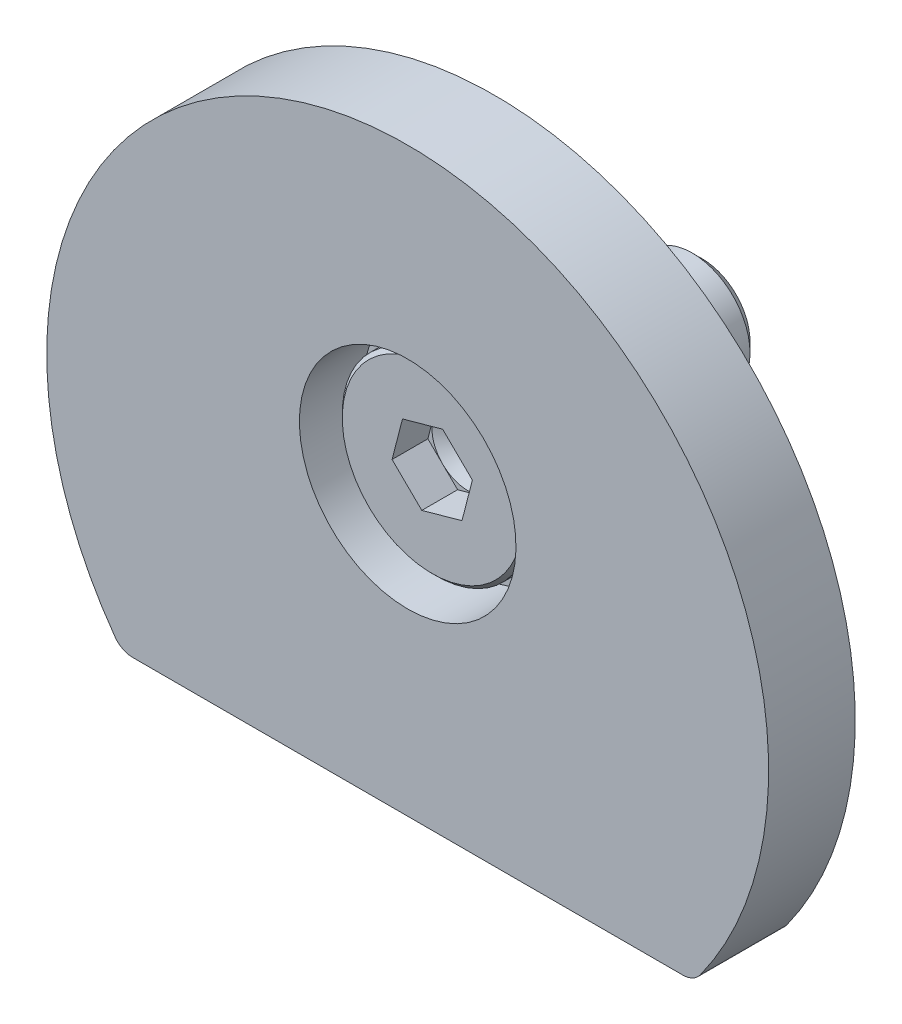
ISO-10303-21;
HEADER;
FILE_DESCRIPTION(('STEP AP214'),'2;1');
FILE_NAME('part.step','',(''),(''),'','','');
FILE_SCHEMA(('AUTOMOTIVE_DESIGN { 1 0 10303 214 1 1 1 1 }'));
ENDSEC;
DATA;
#1=APPLICATION_CONTEXT('core data for automotive mechanical design processes');
#2=APPLICATION_PROTOCOL_DEFINITION('international standard','automotive_design',2000,#1);
#3=PRODUCT_CONTEXT('',#1,'mechanical');
#4=PRODUCT('Part','Part','',(#3));
#5=PRODUCT_RELATED_PRODUCT_CATEGORY('part','',(#4));
#6=PRODUCT_DEFINITION_FORMATION('','',#4);
#7=PRODUCT_DEFINITION_CONTEXT('part definition',#1,'design');
#8=PRODUCT_DEFINITION('design','',#6,#7);
#9=PRODUCT_DEFINITION_SHAPE('','',#8);
#10=(LENGTH_UNIT() NAMED_UNIT(*) SI_UNIT(.MILLI.,.METRE.));
#11=(NAMED_UNIT(*) PLANE_ANGLE_UNIT() SI_UNIT($,.RADIAN.));
#12=(NAMED_UNIT(*) SI_UNIT($,.STERADIAN.) SOLID_ANGLE_UNIT());
#13=UNCERTAINTY_MEASURE_WITH_UNIT(LENGTH_MEASURE(1.E-05),#10,'distance_accuracy_value','');
#14=(GEOMETRIC_REPRESENTATION_CONTEXT(3) GLOBAL_UNCERTAINTY_ASSIGNED_CONTEXT((#13)) GLOBAL_UNIT_ASSIGNED_CONTEXT((#10,
#11,#12)) REPRESENTATION_CONTEXT('',''));
#15=CARTESIAN_POINT('',(0.,0.,0.));
#16=DIRECTION('',(0.,0.,1.));
#17=DIRECTION('',(1.,0.,0.));
#18=AXIS2_PLACEMENT_3D('',#15,#16,#17);
#19=CARTESIAN_POINT('',(19.0502598407476,-13.76,0.));
#20=DIRECTION('',(0.,0.,-1.));
#21=DIRECTION('',(0.,1.,0.));
#22=AXIS2_PLACEMENT_3D('',#19,#20,#21);
#23=CYLINDRICAL_SURFACE('',#22,1.5);
#24=CARTESIAN_POINT('',(19.0502598407476,-13.76,-6.));
#25=DIRECTION('',(0.,0.,1.));
#26=DIRECTION('',(0.,1.,0.));
#27=AXIS2_PLACEMENT_3D('',#24,#25,#26);
#28=CIRCLE('',#27,1.5);
#29=CARTESIAN_POINT('',(19.0502598407476,-15.26,-6.));
#30=VERTEX_POINT('',#29);
#31=CARTESIAN_POINT('',(20.2662338731357,-14.6382978723404,-6.));
#32=VERTEX_POINT('',#31);
#33=EDGE_CURVE('P0_E87',#30,#32,#28,.T.);
#34=ORIENTED_EDGE('',*,*,#33,.T.);
#35=DIRECTION('',(0.,0.,-1.));
#36=VECTOR('',#35,1.);
#37=CARTESIAN_POINT('',(20.2662338731357,-14.6382978723404,0.));
#38=LINE('',#37,#36);
#39=CARTESIAN_POINT('',(20.2662338731357,-14.6382978723404,0.));
#40=VERTEX_POINT('',#39);
#41=EDGE_CURVE('P0_E11',#40,#32,#38,.T.);
#42=ORIENTED_EDGE('',*,*,#41,.F.);
#43=CARTESIAN_POINT('',(19.0502598407476,-13.76,0.));
#44=DIRECTION('',(0.,0.,1.));
#45=DIRECTION('',(0.,1.,0.));
#46=AXIS2_PLACEMENT_3D('',#43,#44,#45);
#47=CIRCLE('',#46,1.5);
#48=CARTESIAN_POINT('',(19.0502598407476,-15.26,0.));
#49=VERTEX_POINT('',#48);
#50=EDGE_CURVE('P0_E69',#49,#40,#47,.T.);
#51=ORIENTED_EDGE('',*,*,#50,.F.);
#52=DIRECTION('',(0.,0.,-1.));
#53=VECTOR('',#52,1.);
#54=CARTESIAN_POINT('',(19.0502598407476,-15.26,0.));
#55=LINE('',#54,#53);
#56=EDGE_CURVE('P0_E83',#49,#30,#55,.T.);
#57=ORIENTED_EDGE('',*,*,#56,.T.);
#58=EDGE_LOOP('',(#34,#42,#51,#57));
#59=FACE_BOUND('',#58,.T.);
#60=ADVANCED_FACE('P0_F17',(#59),#23,.T.);
#61=CARTESIAN_POINT('',(0.,0.,0.));
#62=DIRECTION('',(0.,0.,-1.));
#63=DIRECTION('',(0.,1.,0.));
#64=AXIS2_PLACEMENT_3D('',#61,#62,#63);
#65=CYLINDRICAL_SURFACE('',#64,25.);
#66=CARTESIAN_POINT('',(0.,0.,-6.));
#67=DIRECTION('',(0.,0.,1.));
#68=DIRECTION('',(0.,-1.,0.));
#69=AXIS2_PLACEMENT_3D('',#66,#67,#68);
#70=CIRCLE('',#69,25.);
#71=CARTESIAN_POINT('',(-20.2662338731357,-14.6382978723404,-6.));
#72=VERTEX_POINT('',#71);
#73=EDGE_CURVE('P0_E74',#32,#72,#70,.T.);
#74=ORIENTED_EDGE('',*,*,#73,.T.);
#75=DIRECTION('',(0.,0.,-1.));
#76=VECTOR('',#75,1.);
#77=CARTESIAN_POINT('',(-20.2662338731357,-14.6382978723404,0.));
#78=LINE('',#77,#76);
#79=CARTESIAN_POINT('',(-20.2662338731357,-14.6382978723404,0.));
#80=VERTEX_POINT('',#79);
#81=EDGE_CURVE('P0_E26',#80,#72,#78,.T.);
#82=ORIENTED_EDGE('',*,*,#81,.F.);
#83=CARTESIAN_POINT('',(0.,0.,0.));
#84=DIRECTION('',(0.,0.,1.));
#85=DIRECTION('',(0.,-1.,0.));
#86=AXIS2_PLACEMENT_3D('',#83,#84,#85);
#87=CIRCLE('',#86,25.);
#88=EDGE_CURVE('P0_E64',#40,#80,#87,.T.);
#89=ORIENTED_EDGE('',*,*,#88,.F.);
#90=ORIENTED_EDGE('',*,*,#41,.T.);
#91=EDGE_LOOP('',(#74,#82,#89,#90));
#92=FACE_BOUND('',#91,.T.);
#93=ADVANCED_FACE('P0_F73',(#92),#65,.T.);
#94=CARTESIAN_POINT('',(-19.0502598407476,-13.76,0.));
#95=DIRECTION('',(0.,0.,-1.));
#96=DIRECTION('',(0.,1.,0.));
#97=AXIS2_PLACEMENT_3D('',#94,#95,#96);
#98=CYLINDRICAL_SURFACE('',#97,1.5);
#99=CARTESIAN_POINT('',(-19.0502598407476,-13.76,-6.));
#100=DIRECTION('',(0.,0.,1.));
#101=DIRECTION('',(0.,1.,0.));
#102=AXIS2_PLACEMENT_3D('',#99,#100,#101);
#103=CIRCLE('',#102,1.5);
#104=CARTESIAN_POINT('',(-19.0502598407476,-15.26,-6.));
#105=VERTEX_POINT('',#104);
#106=EDGE_CURVE('P0_E51',#72,#105,#103,.T.);
#107=ORIENTED_EDGE('',*,*,#106,.T.);
#108=DIRECTION('',(0.,0.,-1.));
#109=VECTOR('',#108,1.);
#110=CARTESIAN_POINT('',(-19.0502598407476,-15.26,0.));
#111=LINE('',#110,#109);
#112=CARTESIAN_POINT('',(-19.0502598407476,-15.26,0.));
#113=VERTEX_POINT('',#112);
#114=EDGE_CURVE('P0_E76',#113,#105,#111,.T.);
#115=ORIENTED_EDGE('',*,*,#114,.F.);
#116=CARTESIAN_POINT('',(-19.0502598407476,-13.76,0.));
#117=DIRECTION('',(0.,0.,1.));
#118=DIRECTION('',(0.,1.,0.));
#119=AXIS2_PLACEMENT_3D('',#116,#117,#118);
#120=CIRCLE('',#119,1.5);
#121=EDGE_CURVE('P0_E67',#80,#113,#120,.T.);
#122=ORIENTED_EDGE('',*,*,#121,.F.);
#123=ORIENTED_EDGE('',*,*,#81,.T.);
#124=EDGE_LOOP('',(#107,#115,#122,#123));
#125=FACE_BOUND('',#124,.T.);
#126=ADVANCED_FACE('P0_F77',(#125),#98,.T.);
#127=CARTESIAN_POINT('',(-19.0502598407476,-15.26,0.));
#128=DIRECTION('',(0.,1.,0.));
#129=DIRECTION('',(-1.,0.,0.));
#130=AXIS2_PLACEMENT_3D('',#127,#128,#129);
#131=PLANE('',#130);
#132=DIRECTION('',(1.,0.,0.));
#133=VECTOR('',#132,1.);
#134=CARTESIAN_POINT('',(-19.0502598407476,-15.26,-6.));
#135=LINE('',#134,#133);
#136=EDGE_CURVE('P0_E57',#105,#30,#135,.T.);
#137=ORIENTED_EDGE('',*,*,#136,.T.);
#138=ORIENTED_EDGE('',*,*,#56,.F.);
#139=DIRECTION('',(1.,0.,0.));
#140=VECTOR('',#139,1.);
#141=CARTESIAN_POINT('',(-19.0502598407476,-15.26,0.));
#142=LINE('',#141,#140);
#143=EDGE_CURVE('P0_E34',#113,#49,#142,.T.);
#144=ORIENTED_EDGE('',*,*,#143,.F.);
#145=ORIENTED_EDGE('',*,*,#114,.T.);
#146=EDGE_LOOP('',(#137,#138,#144,#145));
#147=FACE_BOUND('',#146,.T.);
#148=ADVANCED_FACE('P0_F101',(#147),#131,.F.);
#149=CARTESIAN_POINT('',(19.0502598407476,-13.76,0.));
#150=DIRECTION('',(0.,0.,-1.));
#151=DIRECTION('',(0.,1.,0.));
#152=AXIS2_PLACEMENT_3D('',#149,#150,#151);
#153=PLANE('',#152);
#154=CARTESIAN_POINT('',(0.,4.67,0.));
#155=DIRECTION('',(0.,0.,1.));
#156=DIRECTION('',(0.,-1.,0.));
#157=AXIS2_PLACEMENT_3D('',#154,#155,#156);
#158=CIRCLE('',#157,7.5);
#159=CARTESIAN_POINT('',(0.,-2.83,0.));
#160=VERTEX_POINT('',#159);
#161=EDGE_CURVE('P0_E119',#160,#160,#158,.T.);
#162=ORIENTED_EDGE('',*,*,#161,.F.);
#163=EDGE_LOOP('',(#162));
#164=FACE_BOUND('',#163,.T.);
#165=ORIENTED_EDGE('',*,*,#50,.T.);
#166=ORIENTED_EDGE('',*,*,#88,.T.);
#167=ORIENTED_EDGE('',*,*,#121,.T.);
#168=ORIENTED_EDGE('',*,*,#143,.T.);
#169=EDGE_LOOP('',(#165,#166,#167,#168));
#170=FACE_BOUND('',#169,.T.);
#171=ADVANCED_FACE('P0_F65',(#164,#170),#153,.F.);
#172=CARTESIAN_POINT('',(19.0502598407476,-13.76,-6.));
#173=DIRECTION('',(0.,0.,-1.));
#174=DIRECTION('',(0.,1.,0.));
#175=AXIS2_PLACEMENT_3D('',#172,#173,#174);
#176=PLANE('',#175);
#177=CARTESIAN_POINT('',(0.,4.67,-6.));
#178=DIRECTION('',(0.,0.,1.));
#179=DIRECTION('',(0.,-1.,0.));
#180=AXIS2_PLACEMENT_3D('',#177,#178,#179);
#181=CIRCLE('',#180,4.5);
#182=CARTESIAN_POINT('',(0.,0.17,-6.));
#183=VERTEX_POINT('',#182);
#184=EDGE_CURVE('P0_E91',#183,#183,#181,.T.);
#185=ORIENTED_EDGE('',*,*,#184,.T.);
#186=EDGE_LOOP('',(#185));
#187=FACE_BOUND('',#186,.T.);
#188=ORIENTED_EDGE('',*,*,#33,.F.);
#189=ORIENTED_EDGE('',*,*,#136,.F.);
#190=ORIENTED_EDGE('',*,*,#106,.F.);
#191=ORIENTED_EDGE('',*,*,#73,.F.);
#192=EDGE_LOOP('',(#188,#189,#190,#191));
#193=FACE_BOUND('',#192,.T.);
#194=ADVANCED_FACE('P0_F104',(#187,#193),#176,.T.);
#195=CARTESIAN_POINT('',(0.,4.67,0.));
#196=DIRECTION('',(0.,0.,1.));
#197=DIRECTION('',(0.,-1.,0.));
#198=AXIS2_PLACEMENT_3D('',#195,#196,#197);
#199=CYLINDRICAL_SURFACE('',#198,4.5);
#200=ORIENTED_EDGE('',*,*,#184,.F.);
#201=EDGE_LOOP('',(#200));
#202=FACE_BOUND('',#201,.T.);
#203=CARTESIAN_POINT('',(0.,4.67,-4.4));
#204=DIRECTION('',(0.,0.,1.));
#205=DIRECTION('',(0.,-1.,0.));
#206=AXIS2_PLACEMENT_3D('',#203,#204,#205);
#207=CIRCLE('',#206,4.5);
#208=CARTESIAN_POINT('',(0.,0.17,-4.4));
#209=VERTEX_POINT('',#208);
#210=EDGE_CURVE('P0_E111',#209,#209,#207,.T.);
#211=ORIENTED_EDGE('',*,*,#210,.T.);
#212=EDGE_LOOP('',(#211));
#213=FACE_BOUND('',#212,.T.);
#214=ADVANCED_FACE('P0_F131',(#202,#213),#199,.F.);
#215=CARTESIAN_POINT('',(4.5,4.67,-4.4));
#216=DIRECTION('',(0.,0.,-1.));
#217=DIRECTION('',(0.,1.,0.));
#218=AXIS2_PLACEMENT_3D('',#215,#216,#217);
#219=PLANE('',#218);
#220=ORIENTED_EDGE('',*,*,#210,.F.);
#221=EDGE_LOOP('',(#220));
#222=FACE_BOUND('',#221,.T.);
#223=CARTESIAN_POINT('',(0.,4.67,-4.4));
#224=DIRECTION('',(0.,0.,1.));
#225=DIRECTION('',(0.,-1.,0.));
#226=AXIS2_PLACEMENT_3D('',#223,#224,#225);
#227=CIRCLE('',#226,7.5);
#228=CARTESIAN_POINT('',(0.,-2.83,-4.4));
#229=VERTEX_POINT('',#228);
#230=EDGE_CURVE('P0_E115',#229,#229,#227,.T.);
#231=ORIENTED_EDGE('',*,*,#230,.T.);
#232=EDGE_LOOP('',(#231));
#233=FACE_BOUND('',#232,.T.);
#234=ADVANCED_FACE('P0_F169',(#222,#233),#219,.F.);
#235=CARTESIAN_POINT('',(0.,4.67,0.));
#236=DIRECTION('',(0.,0.,1.));
#237=DIRECTION('',(0.,-1.,0.));
#238=AXIS2_PLACEMENT_3D('',#235,#236,#237);
#239=CYLINDRICAL_SURFACE('',#238,7.5);
#240=ORIENTED_EDGE('',*,*,#230,.F.);
#241=EDGE_LOOP('',(#240));
#242=FACE_BOUND('',#241,.T.);
#243=ORIENTED_EDGE('',*,*,#161,.T.);
#244=EDGE_LOOP('',(#243));
#245=FACE_BOUND('',#244,.T.);
#246=ADVANCED_FACE('P0_F123',(#242,#245),#239,.F.);
#247=CLOSED_SHELL('',(#60,#93,#126,#148,#171,#194,#214,#234,#246));
#248=MANIFOLD_SOLID_BREP('P0_B1',#247);
#249=CARTESIAN_POINT('',(0.,4.67,-1.7));
#250=DIRECTION('',(0.,0.,1.));
#251=DIRECTION('',(-0.700576633181684,-0.713577172448655,0.));
#252=AXIS2_PLACEMENT_3D('',#249,#250,#251);
#253=PLANE('',#252);
#254=DIRECTION('',(-0.963505747857437,-0.267687642310362,0.));
#255=VECTOR('',#254,1.);
#256=CARTESIAN_POINT('',(2.05991986300401,2.64760946122297,-1.7));
#257=LINE('',#256,#255);
#258=CARTESIAN_POINT('',(2.05991986300401,2.64760946122297,-1.7));
#259=VERTEX_POINT('',#258);
#260=CARTESIAN_POINT('',(-0.721481651452197,1.87486179948985,-1.7));
#261=VERTEX_POINT('',#260);
#262=EDGE_CURVE('P1_E465',#259,#261,#257,.T.);
#263=ORIENTED_EDGE('',*,*,#262,.T.);
#264=DIRECTION('',(0.713577172448656,-0.700576633181682,0.));
#265=VECTOR('',#264,1.);
#266=CARTESIAN_POINT('',(-2.78140151445622,3.89725233826689,-1.7));
#267=LINE('',#266,#265);
#268=CARTESIAN_POINT('',(-2.78140151445622,3.89725233826689,-1.7));
#269=VERTEX_POINT('',#268);
#270=EDGE_CURVE('P1_E117',#269,#261,#267,.T.);
#271=ORIENTED_EDGE('',*,*,#270,.F.);
#272=DIRECTION('',(0.249928575408783,0.968264275492046,0.));
#273=VECTOR('',#272,1.);
#274=CARTESIAN_POINT('',(-2.78140151445622,3.89725233826689,-1.7));
#275=LINE('',#274,#273);
#276=CARTESIAN_POINT('',(-2.05991986300401,6.69239053877704,-1.7));
#277=VERTEX_POINT('',#276);
#278=EDGE_CURVE('P1_E469',#269,#277,#275,.T.);
#279=ORIENTED_EDGE('',*,*,#278,.T.);
#280=DIRECTION('',(0.963505747857438,0.267687642310359,0.));
#281=VECTOR('',#280,1.);
#282=CARTESIAN_POINT('',(-2.05991986300401,6.69239053877704,-1.7));
#283=LINE('',#282,#281);
#284=CARTESIAN_POINT('',(0.721481651452201,7.46513820051014,-1.7));
#285=VERTEX_POINT('',#284);
#286=EDGE_CURVE('P1_E472',#277,#285,#283,.T.);
#287=ORIENTED_EDGE('',*,*,#286,.T.);
#288=DIRECTION('',(-0.713577172448655,0.700576633181683,0.));
#289=VECTOR('',#288,1.);
#290=CARTESIAN_POINT('',(2.78140151445621,5.44274766173312,-1.7));
#291=LINE('',#290,#289);
#292=CARTESIAN_POINT('',(2.78140151445621,5.44274766173312,-1.7));
#293=VERTEX_POINT('',#292);
#294=EDGE_CURVE('P1_E476',#293,#285,#291,.T.);
#295=ORIENTED_EDGE('',*,*,#294,.F.);
#296=DIRECTION('',(0.249928575408783,0.968264275492046,0.));
#297=VECTOR('',#296,1.);
#298=CARTESIAN_POINT('',(2.05991986300401,2.64760946122297,-1.7));
#299=LINE('',#298,#297);
#300=EDGE_CURVE('P1_E112',#259,#293,#299,.T.);
#301=ORIENTED_EDGE('',*,*,#300,.F.);
#302=EDGE_LOOP('',(#263,#271,#279,#287,#295,#301));
#303=FACE_BOUND('',#302,.T.);
#304=CARTESIAN_POINT('',(0.,4.67,-1.7));
#305=DIRECTION('',(0.,0.,1.));
#306=DIRECTION('',(-0.700576633181684,-0.713577172448655,0.));
#307=AXIS2_PLACEMENT_3D('',#304,#305,#306);
#308=CIRCLE('',#307,6.23);
#309=CARTESIAN_POINT('',(-4.36459242472189,0.224414215644885,-1.7));
#310=VERTEX_POINT('',#309);
#311=EDGE_CURVE('P1_E135',#310,#310,#308,.T.);
#312=ORIENTED_EDGE('',*,*,#311,.T.);
#313=EDGE_LOOP('',(#312));
#314=FACE_BOUND('',#313,.T.);
#315=ADVANCED_FACE('P1_F18',(#303,#314),#253,.T.);
#316=CARTESIAN_POINT('',(2.36194044080505,2.35109134416863,-20.4));
#317=DIRECTION('',(0.,0.,-1.));
#318=DIRECTION('',(0.700576633181684,0.713577172448655,0.));
#319=AXIS2_PLACEMENT_3D('',#316,#317,#318);
#320=PLANE('',#319);
#321=CARTESIAN_POINT('',(0.,4.67,-20.4));
#322=DIRECTION('',(0.,0.,1.));
#323=DIRECTION('',(-0.700576633181684,-0.713577172448655,0.));
#324=AXIS2_PLACEMENT_3D('',#321,#322,#323);
#325=CIRCLE('',#324,3.31);
#326=CARTESIAN_POINT('',(-2.31890865583137,2.30805955919495,-20.4));
#327=VERTEX_POINT('',#326);
#328=EDGE_CURVE('P1_E11',#327,#327,#325,.T.);
#329=ORIENTED_EDGE('',*,*,#328,.F.);
#330=EDGE_LOOP('',(#329));
#331=FACE_BOUND('',#330,.T.);
#332=ADVANCED_FACE('P1_F20',(#331),#320,.T.);
#333=CARTESIAN_POINT('',(0.,4.67,-20.4));
#334=DIRECTION('',(0.,0.,1.));
#335=DIRECTION('',(-0.700576633181684,-0.713577172448655,0.));
#336=AXIS2_PLACEMENT_3D('',#333,#334,#335);
#337=CONICAL_SURFACE('',#336,3.31,0.785398163397386);
#338=CARTESIAN_POINT('',(0.,4.67,-19.71));
#339=DIRECTION('',(0.,0.,1.));
#340=DIRECTION('',(-0.700576633181684,-0.713577172448655,0.));
#341=AXIS2_PLACEMENT_3D('',#338,#339,#340);
#342=CIRCLE('',#341,3.99999999999995);
#343=CARTESIAN_POINT('',(-2.8023065327267,1.81569131020542,-19.71));
#344=VERTEX_POINT('',#343);
#345=EDGE_CURVE('P1_E27',#344,#344,#342,.T.);
#346=ORIENTED_EDGE('',*,*,#345,.F.);
#347=EDGE_LOOP('',(#346));
#348=FACE_BOUND('',#347,.T.);
#349=ORIENTED_EDGE('',*,*,#328,.T.);
#350=EDGE_LOOP('',(#349));
#351=FACE_BOUND('',#350,.T.);
#352=ADVANCED_FACE('P1_F164',(#348,#351),#337,.T.);
#353=CARTESIAN_POINT('',(0.,4.67,30.05));
#354=DIRECTION('',(0.,0.,1.));
#355=DIRECTION('',(-0.700576633181684,-0.713577172448655,0.));
#356=AXIS2_PLACEMENT_3D('',#353,#354,#355);
#357=CYLINDRICAL_SURFACE('',#356,3.99999999999994);
#358=ORIENTED_EDGE('',*,*,#345,.T.);
#359=EDGE_LOOP('',(#358));
#360=FACE_BOUND('',#359,.T.);
#361=CARTESIAN_POINT('',(0.,4.67,-4.535));
#362=DIRECTION('',(0.,0.,1.));
#363=DIRECTION('',(-0.700576633181684,-0.713577172448655,0.));
#364=AXIS2_PLACEMENT_3D('',#361,#362,#363);
#365=CIRCLE('',#364,3.99999999999994);
#366=CARTESIAN_POINT('',(-2.8023065327267,1.81569131020542,-4.535));
#367=VERTEX_POINT('',#366);
#368=EDGE_CURVE('P1_E152',#367,#367,#365,.T.);
#369=ORIENTED_EDGE('',*,*,#368,.F.);
#370=EDGE_LOOP('',(#369));
#371=FACE_BOUND('',#370,.T.);
#372=ADVANCED_FACE('P1_F161',(#360,#371),#357,.T.);
#373=CARTESIAN_POINT('',(0.,4.67,-4.535));
#374=DIRECTION('',(0.,0.,1.));
#375=DIRECTION('',(-0.700576633181684,-0.713577172448655,0.));
#376=AXIS2_PLACEMENT_3D('',#373,#374,#375);
#377=TOROIDAL_SURFACE('',#376,4.13499999999994,0.135);
#378=ORIENTED_EDGE('',*,*,#368,.T.);
#379=EDGE_LOOP('',(#378));
#380=FACE_BOUND('',#379,.T.);
#381=CARTESIAN_POINT('',(0.,4.67,-4.4));
#382=DIRECTION('',(0.,0.,1.));
#383=DIRECTION('',(-0.700576633181684,-0.713577172448655,0.));
#384=AXIS2_PLACEMENT_3D('',#381,#382,#383);
#385=CIRCLE('',#384,4.13499999999994);
#386=CARTESIAN_POINT('',(-2.89688437820622,1.71935839192485,-4.4));
#387=VERTEX_POINT('',#386);
#388=EDGE_CURVE('P1_E148',#387,#387,#385,.T.);
#389=ORIENTED_EDGE('',*,*,#388,.F.);
#390=EDGE_LOOP('',(#389));
#391=FACE_BOUND('',#390,.T.);
#392=ADVANCED_FACE('P1_F192',(#380,#391),#377,.F.);
#393=CARTESIAN_POINT('',(4.63825162091626,0.116251884319057,-4.4));
#394=DIRECTION('',(0.,0.,-1.));
#395=DIRECTION('',(0.700576633181684,0.713577172448655,0.));
#396=AXIS2_PLACEMENT_3D('',#393,#394,#395);
#397=PLANE('',#396);
#398=ORIENTED_EDGE('',*,*,#388,.T.);
#399=EDGE_LOOP('',(#398));
#400=FACE_BOUND('',#399,.T.);
#401=CARTESIAN_POINT('',(0.,4.67,-4.4));
#402=DIRECTION('',(0.,0.,1.));
#403=DIRECTION('',(-0.700576633181684,-0.713577172448655,0.));
#404=AXIS2_PLACEMENT_3D('',#401,#402,#403);
#405=CIRCLE('',#404,6.5);
#406=CARTESIAN_POINT('',(-4.55374811568094,0.0317483790837451,-4.4));
#407=VERTEX_POINT('',#406);
#408=EDGE_CURVE('P1_E144',#407,#407,#405,.T.);
#409=ORIENTED_EDGE('',*,*,#408,.F.);
#410=EDGE_LOOP('',(#409));
#411=FACE_BOUND('',#410,.T.);
#412=ADVANCED_FACE('P1_F188',(#400,#411),#397,.T.);
#413=CARTESIAN_POINT('',(0.,4.67,30.05));
#414=DIRECTION('',(0.,0.,1.));
#415=DIRECTION('',(-0.700576633181684,-0.713577172448655,0.));
#416=AXIS2_PLACEMENT_3D('',#413,#414,#415);
#417=CYLINDRICAL_SURFACE('',#416,6.5);
#418=ORIENTED_EDGE('',*,*,#408,.T.);
#419=EDGE_LOOP('',(#418));
#420=FACE_BOUND('',#419,.T.);
#421=CARTESIAN_POINT('',(0.,4.67,-1.97));
#422=DIRECTION('',(0.,0.,1.));
#423=DIRECTION('',(-0.700576633181684,-0.713577172448655,0.));
#424=AXIS2_PLACEMENT_3D('',#421,#422,#423);
#425=CIRCLE('',#424,6.5);
#426=CARTESIAN_POINT('',(-4.55374811568094,0.0317483790837451,-1.97));
#427=VERTEX_POINT('',#426);
#428=EDGE_CURVE('P1_E140',#427,#427,#425,.T.);
#429=ORIENTED_EDGE('',*,*,#428,.F.);
#430=EDGE_LOOP('',(#429));
#431=FACE_BOUND('',#430,.T.);
#432=ADVANCED_FACE('P1_F184',(#420,#431),#417,.T.);
#433=CARTESIAN_POINT('',(0.,4.67,-1.7));
#434=DIRECTION('',(0.,0.,-1.));
#435=DIRECTION('',(0.700576633181684,0.713577172448655,0.));
#436=AXIS2_PLACEMENT_3D('',#433,#434,#435);
#437=CONICAL_SURFACE('',#436,6.23,0.785398163397456);
#438=ORIENTED_EDGE('',*,*,#428,.T.);
#439=EDGE_LOOP('',(#438));
#440=FACE_BOUND('',#439,.T.);
#441=ORIENTED_EDGE('',*,*,#311,.F.);
#442=EDGE_LOOP('',(#441));
#443=FACE_BOUND('',#442,.T.);
#444=ADVANCED_FACE('P1_F181',(#440,#443),#437,.T.);
#445=CARTESIAN_POINT('',(2.05991986300401,2.64760946122297,-4.18));
#446=DIRECTION('',(-0.267687642310362,0.963505747857437,0.));
#447=DIRECTION('',(0.963505747857437,0.267687642310362,0.));
#448=AXIS2_PLACEMENT_3D('',#445,#446,#447);
#449=PLANE('',#448);
#450=ORIENTED_EDGE('',*,*,#262,.F.);
#451=DIRECTION('',(0.,0.,1.));
#452=VECTOR('',#451,1.);
#453=CARTESIAN_POINT('',(2.05991986300401,2.64760946122297,-4.18));
#454=LINE('',#453,#452);
#455=CARTESIAN_POINT('',(2.05991986300401,2.64760946122297,-4.18));
#456=VERTEX_POINT('',#455);
#457=EDGE_CURVE('P1_E464',#456,#259,#454,.T.);
#458=ORIENTED_EDGE('',*,*,#457,.F.);
#459=DIRECTION('',(-0.963505747857437,-0.267687642310362,0.));
#460=VECTOR('',#459,1.);
#461=CARTESIAN_POINT('',(2.05991986300401,2.64760946122297,-4.18));
#462=LINE('',#461,#460);
#463=CARTESIAN_POINT('',(0.669219105775905,2.26123563035641,-4.18));
#464=VERTEX_POINT('',#463);
#465=EDGE_CURVE('P1_E103',#456,#464,#462,.T.);
#466=ORIENTED_EDGE('',*,*,#465,.T.);
#467=CARTESIAN_POINT('',(-0.721481651452197,1.87486179948985,-4.18));
#468=VERTEX_POINT('',#467);
#469=EDGE_CURVE('P1_E93',#464,#468,#462,.T.);
#470=ORIENTED_EDGE('',*,*,#469,.T.);
#471=DIRECTION('',(0.,0.,1.));
#472=VECTOR('',#471,1.);
#473=CARTESIAN_POINT('',(-0.721481651452197,1.87486179948985,-4.18));
#474=LINE('',#473,#472);
#475=EDGE_CURVE('P1_E108',#468,#261,#474,.T.);
#476=ORIENTED_EDGE('',*,*,#475,.T.);
#477=EDGE_LOOP('',(#450,#458,#466,#470,#476));
#478=FACE_BOUND('',#477,.T.);
#479=ADVANCED_FACE('P1_F107',(#478),#449,.T.);
#480=CARTESIAN_POINT('',(-2.78140151445622,3.89725233826689,-4.18));
#481=DIRECTION('',(-0.700576633181682,-0.713577172448656,0.));
#482=DIRECTION('',(-0.713577172448656,0.700576633181682,0.));
#483=AXIS2_PLACEMENT_3D('',#480,#481,#482);
#484=PLANE('',#483);
#485=ORIENTED_EDGE('',*,*,#270,.T.);
#486=ORIENTED_EDGE('',*,*,#475,.F.);
#487=DIRECTION('',(0.713577172448656,-0.700576633181682,0.));
#488=VECTOR('',#487,1.);
#489=CARTESIAN_POINT('',(-2.78140151445622,3.89725233826689,-4.18));
#490=LINE('',#489,#488);
#491=CARTESIAN_POINT('',(-1.7514415829542,2.88605706887836,-4.18));
#492=VERTEX_POINT('',#491);
#493=EDGE_CURVE('P1_E90',#492,#468,#490,.T.);
#494=ORIENTED_EDGE('',*,*,#493,.F.);
#495=CARTESIAN_POINT('',(-2.78140151445622,3.89725233826689,-4.18));
#496=VERTEX_POINT('',#495);
#497=EDGE_CURVE('P1_E102',#496,#492,#490,.T.);
#498=ORIENTED_EDGE('',*,*,#497,.F.);
#499=DIRECTION('',(0.,0.,1.));
#500=VECTOR('',#499,1.);
#501=CARTESIAN_POINT('',(-2.78140151445622,3.89725233826689,-4.18));
#502=LINE('',#501,#500);
#503=EDGE_CURVE('P1_E120',#496,#269,#502,.T.);
#504=ORIENTED_EDGE('',*,*,#503,.T.);
#505=EDGE_LOOP('',(#485,#486,#494,#498,#504));
#506=FACE_BOUND('',#505,.T.);
#507=ADVANCED_FACE('P1_F114',(#506),#484,.F.);
#508=CARTESIAN_POINT('',(-2.78140151445622,3.89725233826689,-4.18));
#509=DIRECTION('',(0.968264275492046,-0.249928575408783,0.));
#510=DIRECTION('',(-0.249928575408783,-0.968264275492046,0.));
#511=AXIS2_PLACEMENT_3D('',#508,#509,#510);
#512=PLANE('',#511);
#513=ORIENTED_EDGE('',*,*,#278,.F.);
#514=ORIENTED_EDGE('',*,*,#503,.F.);
#515=DIRECTION('',(0.249928575408783,0.968264275492046,0.));
#516=VECTOR('',#515,1.);
#517=CARTESIAN_POINT('',(-2.78140151445622,3.89725233826689,-4.18));
#518=LINE('',#517,#516);
#519=CARTESIAN_POINT('',(-2.42066068873012,5.29482143852196,-4.18));
#520=VERTEX_POINT('',#519);
#521=EDGE_CURVE('P1_E440',#496,#520,#518,.T.);
#522=ORIENTED_EDGE('',*,*,#521,.T.);
#523=CARTESIAN_POINT('',(-2.05991986300401,6.69239053877704,-4.18));
#524=VERTEX_POINT('',#523);
#525=EDGE_CURVE('P1_E442',#520,#524,#518,.T.);
#526=ORIENTED_EDGE('',*,*,#525,.T.);
#527=DIRECTION('',(0.,0.,1.));
#528=VECTOR('',#527,1.);
#529=CARTESIAN_POINT('',(-2.05991986300401,6.69239053877704,-4.18));
#530=LINE('',#529,#528);
#531=EDGE_CURVE('P1_E130',#524,#277,#530,.T.);
#532=ORIENTED_EDGE('',*,*,#531,.T.);
#533=EDGE_LOOP('',(#513,#514,#522,#526,#532));
#534=FACE_BOUND('',#533,.T.);
#535=ADVANCED_FACE('P1_F224',(#534),#512,.T.);
#536=CARTESIAN_POINT('',(-2.05991986300401,6.69239053877704,-4.18));
#537=DIRECTION('',(0.267687642310359,-0.963505747857438,0.));
#538=DIRECTION('',(-0.963505747857438,-0.267687642310359,0.));
#539=AXIS2_PLACEMENT_3D('',#536,#537,#538);
#540=PLANE('',#539);
#541=ORIENTED_EDGE('',*,*,#286,.F.);
#542=ORIENTED_EDGE('',*,*,#531,.F.);
#543=DIRECTION('',(0.963505747857438,0.267687642310359,0.));
#544=VECTOR('',#543,1.);
#545=CARTESIAN_POINT('',(-2.05991986300401,6.69239053877704,-4.18));
#546=LINE('',#545,#544);
#547=CARTESIAN_POINT('',(-0.669219105775897,7.07876436964359,-4.18));
#548=VERTEX_POINT('',#547);
#549=EDGE_CURVE('P1_E445',#524,#548,#546,.T.);
#550=ORIENTED_EDGE('',*,*,#549,.T.);
#551=CARTESIAN_POINT('',(0.721481651452201,7.46513820051014,-4.18));
#552=VERTEX_POINT('',#551);
#553=EDGE_CURVE('P1_E451',#548,#552,#546,.T.);
#554=ORIENTED_EDGE('',*,*,#553,.T.);
#555=DIRECTION('',(0.,0.,1.));
#556=VECTOR('',#555,1.);
#557=CARTESIAN_POINT('',(0.721481651452201,7.46513820051014,-4.18));
#558=LINE('',#557,#556);
#559=EDGE_CURVE('P1_E489',#552,#285,#558,.T.);
#560=ORIENTED_EDGE('',*,*,#559,.T.);
#561=EDGE_LOOP('',(#541,#542,#550,#554,#560));
#562=FACE_BOUND('',#561,.T.);
#563=ADVANCED_FACE('P1_F230',(#562),#540,.T.);
#564=CARTESIAN_POINT('',(2.78140151445621,5.44274766173312,-4.18));
#565=DIRECTION('',(0.700576633181683,0.713577172448655,0.));
#566=DIRECTION('',(0.713577172448655,-0.700576633181683,0.));
#567=AXIS2_PLACEMENT_3D('',#564,#565,#566);
#568=PLANE('',#567);
#569=ORIENTED_EDGE('',*,*,#294,.T.);
#570=ORIENTED_EDGE('',*,*,#559,.F.);
#571=DIRECTION('',(-0.713577172448655,0.700576633181683,0.));
#572=VECTOR('',#571,1.);
#573=CARTESIAN_POINT('',(2.78140151445621,5.44274766173312,-4.18));
#574=LINE('',#573,#572);
#575=CARTESIAN_POINT('',(1.75144158295421,6.45394293112164,-4.18));
#576=VERTEX_POINT('',#575);
#577=EDGE_CURVE('P1_E456',#576,#552,#574,.T.);
#578=ORIENTED_EDGE('',*,*,#577,.F.);
#579=CARTESIAN_POINT('',(2.78140151445621,5.44274766173312,-4.18));
#580=VERTEX_POINT('',#579);
#581=EDGE_CURVE('P1_E34',#580,#576,#574,.T.);
#582=ORIENTED_EDGE('',*,*,#581,.F.);
#583=DIRECTION('',(0.,0.,1.));
#584=VECTOR('',#583,1.);
#585=CARTESIAN_POINT('',(2.78140151445621,5.44274766173312,-4.18));
#586=LINE('',#585,#584);
#587=EDGE_CURVE('P1_E485',#580,#293,#586,.T.);
#588=ORIENTED_EDGE('',*,*,#587,.T.);
#589=EDGE_LOOP('',(#569,#570,#578,#582,#588));
#590=FACE_BOUND('',#589,.T.);
#591=ADVANCED_FACE('P1_F237',(#590),#568,.F.);
#592=CARTESIAN_POINT('',(2.05991986300401,2.64760946122297,-4.18));
#593=DIRECTION('',(0.968264275492046,-0.249928575408783,0.));
#594=DIRECTION('',(-0.249928575408783,-0.968264275492046,0.));
#595=AXIS2_PLACEMENT_3D('',#592,#593,#594);
#596=PLANE('',#595);
#597=ORIENTED_EDGE('',*,*,#300,.T.);
#598=ORIENTED_EDGE('',*,*,#587,.F.);
#599=DIRECTION('',(0.249928575408783,0.968264275492046,0.));
#600=VECTOR('',#599,1.);
#601=CARTESIAN_POINT('',(2.05991986300401,2.64760946122297,-4.18));
#602=LINE('',#601,#600);
#603=CARTESIAN_POINT('',(2.42066068873011,4.04517856147804,-4.18));
#604=VERTEX_POINT('',#603);
#605=EDGE_CURVE('P1_E459',#604,#580,#602,.T.);
#606=ORIENTED_EDGE('',*,*,#605,.F.);
#607=EDGE_CURVE('P1_E460',#456,#604,#602,.T.);
#608=ORIENTED_EDGE('',*,*,#607,.F.);
#609=ORIENTED_EDGE('',*,*,#457,.T.);
#610=EDGE_LOOP('',(#597,#598,#606,#608,#609));
#611=FACE_BOUND('',#610,.T.);
#612=ADVANCED_FACE('P1_F244',(#611),#596,.F.);
#613=CARTESIAN_POINT('',(2.05991986300401,2.64760946122297,-4.18));
#614=DIRECTION('',(0.,0.,-1.));
#615=DIRECTION('',(0.700576633181684,0.713577172448655,0.));
#616=AXIS2_PLACEMENT_3D('',#613,#614,#615);
#617=PLANE('',#616);
#618=ORIENTED_EDGE('',*,*,#577,.T.);
#619=ORIENTED_EDGE('',*,*,#553,.F.);
#620=CARTESIAN_POINT('',(0.,4.67,-4.18));
#621=DIRECTION('',(0.,0.,1.));
#622=DIRECTION('',(-0.700576633181684,-0.713577172448655,0.));
#623=AXIS2_PLACEMENT_3D('',#620,#621,#622);
#624=CIRCLE('',#623,2.5);
#625=EDGE_CURVE('P1_E504',#576,#548,#624,.T.);
#626=ORIENTED_EDGE('',*,*,#625,.F.);
#627=EDGE_LOOP('',(#618,#619,#626));
#628=FACE_BOUND('',#627,.T.);
#629=ADVANCED_FACE('P1_F251',(#628),#617,.F.);
#630=ORIENTED_EDGE('',*,*,#549,.F.);
#631=ORIENTED_EDGE('',*,*,#525,.F.);
#632=EDGE_CURVE('P1_E127',#548,#520,#624,.T.);
#633=ORIENTED_EDGE('',*,*,#632,.F.);
#634=EDGE_LOOP('',(#630,#631,#633));
#635=FACE_BOUND('',#634,.T.);
#636=ADVANCED_FACE('P1_F258',(#635),#617,.F.);
#637=ORIENTED_EDGE('',*,*,#521,.F.);
#638=ORIENTED_EDGE('',*,*,#497,.T.);
#639=EDGE_CURVE('P1_E119',#520,#492,#624,.T.);
#640=ORIENTED_EDGE('',*,*,#639,.F.);
#641=EDGE_LOOP('',(#637,#638,#640));
#642=FACE_BOUND('',#641,.T.);
#643=ADVANCED_FACE('P1_F266',(#642),#617,.F.);
#644=ORIENTED_EDGE('',*,*,#493,.T.);
#645=ORIENTED_EDGE('',*,*,#469,.F.);
#646=EDGE_CURVE('P1_E96',#492,#464,#624,.T.);
#647=ORIENTED_EDGE('',*,*,#646,.F.);
#648=EDGE_LOOP('',(#644,#645,#647));
#649=FACE_BOUND('',#648,.T.);
#650=ADVANCED_FACE('P1_F92',(#649),#617,.F.);
#651=ORIENTED_EDGE('',*,*,#465,.F.);
#652=ORIENTED_EDGE('',*,*,#607,.T.);
#653=EDGE_CURVE('P1_E136',#464,#604,#624,.T.);
#654=ORIENTED_EDGE('',*,*,#653,.F.);
#655=EDGE_LOOP('',(#651,#652,#654));
#656=FACE_BOUND('',#655,.T.);
#657=ADVANCED_FACE('P1_F277',(#656),#617,.F.);
#658=ORIENTED_EDGE('',*,*,#605,.T.);
#659=ORIENTED_EDGE('',*,*,#581,.T.);
#660=EDGE_CURVE('P1_E502',#604,#576,#624,.T.);
#661=ORIENTED_EDGE('',*,*,#660,.F.);
#662=EDGE_LOOP('',(#658,#659,#661));
#663=FACE_BOUND('',#662,.T.);
#664=ADVANCED_FACE('P1_F261',(#663),#617,.F.);
#665=CARTESIAN_POINT('',(0.,4.67,-4.18));
#666=DIRECTION('',(0.,0.,1.));
#667=DIRECTION('',(-0.700576633181684,-0.713577172448655,0.));
#668=AXIS2_PLACEMENT_3D('',#665,#666,#667);
#669=CONICAL_SURFACE('',#668,2.5,1.04719755119659);
#670=CARTESIAN_POINT('',(0.,4.67,-5.62337567297409));
#671=VERTEX_POINT('',#670);
#672=VERTEX_LOOP('',#671);
#673=FACE_BOUND('',#672,.T.);
#674=ORIENTED_EDGE('',*,*,#646,.T.);
#675=ORIENTED_EDGE('',*,*,#653,.T.);
#676=ORIENTED_EDGE('',*,*,#660,.T.);
#677=ORIENTED_EDGE('',*,*,#625,.T.);
#678=ORIENTED_EDGE('',*,*,#632,.T.);
#679=ORIENTED_EDGE('',*,*,#639,.T.);
#680=EDGE_LOOP('',(#674,#675,#676,#677,#678,#679));
#681=FACE_BOUND('',#680,.T.);
#682=ADVANCED_FACE('P1_F179',(#673,#681),#669,.F.);
#683=CLOSED_SHELL('',(#315,#332,#352,#372,#392,#412,#432,#444,#479,#507,#535,#563,#591,#612,
#629,#636,#643,#650,#657,#664,#682));
#684=MANIFOLD_SOLID_BREP('P1_B1',#683);
#685=ADVANCED_BREP_SHAPE_REPRESENTATION('',(#18,#248,#684),#14);
#686=SHAPE_DEFINITION_REPRESENTATION(#9,#685);
ENDSEC;
END-ISO-10303-21;
